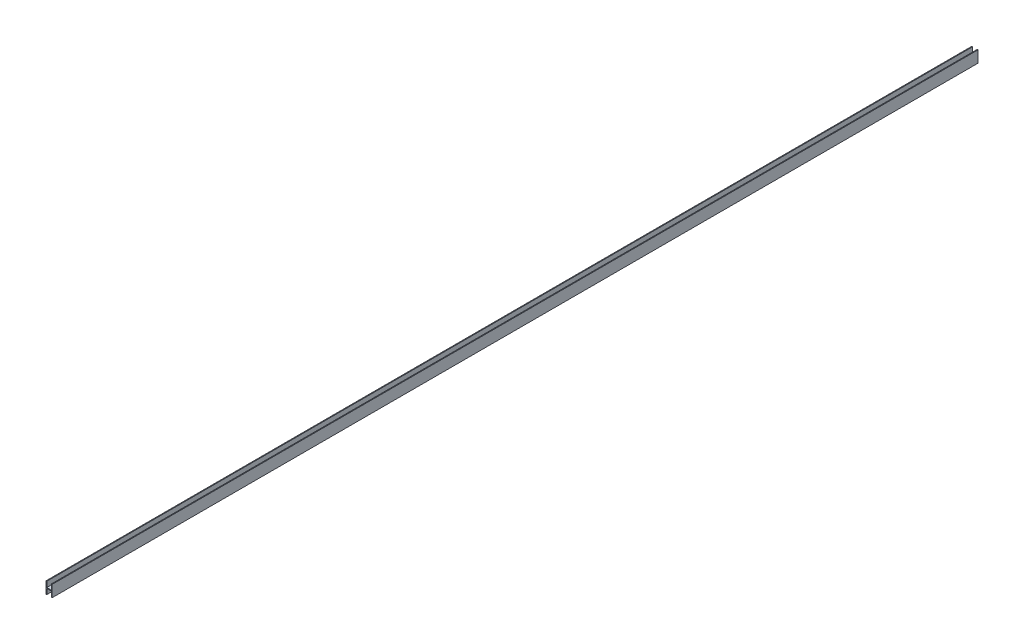
ISO-10303-21;
HEADER;
FILE_DESCRIPTION(('STEP AP214'),'2;1');
FILE_NAME('part.step','',(''),(''),'','','');
FILE_SCHEMA(('AUTOMOTIVE_DESIGN { 1 0 10303 214 1 1 1 1 }'));
ENDSEC;
DATA;
#1=APPLICATION_CONTEXT('core data for automotive mechanical design processes');
#2=APPLICATION_PROTOCOL_DEFINITION('international standard','automotive_design',2000,#1);
#3=PRODUCT_CONTEXT('',#1,'mechanical');
#4=PRODUCT('Part','Part','',(#3));
#5=PRODUCT_RELATED_PRODUCT_CATEGORY('part','',(#4));
#6=PRODUCT_DEFINITION_FORMATION('','',#4);
#7=PRODUCT_DEFINITION_CONTEXT('part definition',#1,'design');
#8=PRODUCT_DEFINITION('design','',#6,#7);
#9=PRODUCT_DEFINITION_SHAPE('','',#8);
#10=(LENGTH_UNIT() NAMED_UNIT(*) SI_UNIT(.MILLI.,.METRE.));
#11=(NAMED_UNIT(*) PLANE_ANGLE_UNIT() SI_UNIT($,.RADIAN.));
#12=(NAMED_UNIT(*) SI_UNIT($,.STERADIAN.) SOLID_ANGLE_UNIT());
#13=UNCERTAINTY_MEASURE_WITH_UNIT(LENGTH_MEASURE(1.E-05),#10,'distance_accuracy_value','');
#14=(GEOMETRIC_REPRESENTATION_CONTEXT(3) GLOBAL_UNCERTAINTY_ASSIGNED_CONTEXT((#13)) GLOBAL_UNIT_ASSIGNED_CONTEXT((#10,
#11,#12)) REPRESENTATION_CONTEXT('',''));
#15=CARTESIAN_POINT('',(0.,0.,0.));
#16=DIRECTION('',(0.,0.,1.));
#17=DIRECTION('',(1.,0.,0.));
#18=AXIS2_PLACEMENT_3D('',#15,#16,#17);
#19=CARTESIAN_POINT('',(-4.,7.5,1200.));
#20=DIRECTION('',(0.,-1.,0.));
#21=DIRECTION('',(0.,0.,-1.));
#22=AXIS2_PLACEMENT_3D('',#19,#20,#21);
#23=PLANE('',#22);
#24=DIRECTION('',(-1.,0.,0.));
#25=VECTOR('',#24,1.);
#26=CARTESIAN_POINT('',(-4.,7.5,1200.));
#27=LINE('',#26,#25);
#28=CARTESIAN_POINT('',(-3.,7.5,1200.));
#29=VERTEX_POINT('',#28);
#30=CARTESIAN_POINT('',(-4.,7.5,1200.));
#31=VERTEX_POINT('',#30);
#32=EDGE_CURVE('E207',#29,#31,#27,.T.);
#33=ORIENTED_EDGE('',*,*,#32,.F.);
#34=DIRECTION('',(0.,0.,-1.));
#35=VECTOR('',#34,1.);
#36=CARTESIAN_POINT('',(-3.,7.5,1200.));
#37=LINE('',#36,#35);
#38=CARTESIAN_POINT('',(-3.,7.5,0.));
#39=VERTEX_POINT('',#38);
#40=EDGE_CURVE('E182',#29,#39,#37,.T.);
#41=ORIENTED_EDGE('',*,*,#40,.T.);
#42=DIRECTION('',(-1.,0.,0.));
#43=VECTOR('',#42,1.);
#44=CARTESIAN_POINT('',(-4.,7.5,0.));
#45=LINE('',#44,#43);
#46=CARTESIAN_POINT('',(-4.,7.5,0.));
#47=VERTEX_POINT('',#46);
#48=EDGE_CURVE('E225',#39,#47,#45,.T.);
#49=ORIENTED_EDGE('',*,*,#48,.T.);
#50=DIRECTION('',(0.,0.,-1.));
#51=VECTOR('',#50,1.);
#52=CARTESIAN_POINT('',(-4.,7.5,1200.));
#53=LINE('',#52,#51);
#54=EDGE_CURVE('E243',#31,#47,#53,.T.);
#55=ORIENTED_EDGE('',*,*,#54,.F.);
#56=EDGE_LOOP('',(#33,#41,#49,#55));
#57=FACE_BOUND('',#56,.T.);
#58=ADVANCED_FACE('F39',(#57),#23,.F.);
#59=CARTESIAN_POINT('',(-4.,-7.5,1200.));
#60=DIRECTION('',(0.,1.,0.));
#61=DIRECTION('',(0.,0.,1.));
#62=AXIS2_PLACEMENT_3D('',#59,#60,#61);
#63=PLANE('',#62);
#64=DIRECTION('',(1.,0.,0.));
#65=VECTOR('',#64,1.);
#66=CARTESIAN_POINT('',(-4.,-7.5,0.));
#67=LINE('',#66,#65);
#68=CARTESIAN_POINT('',(-4.,-7.5,0.));
#69=VERTEX_POINT('',#68);
#70=CARTESIAN_POINT('',(-3.,-7.5,0.));
#71=VERTEX_POINT('',#70);
#72=EDGE_CURVE('E208',#69,#71,#67,.T.);
#73=ORIENTED_EDGE('',*,*,#72,.T.);
#74=DIRECTION('',(0.,0.,1.));
#75=VECTOR('',#74,1.);
#76=CARTESIAN_POINT('',(-3.,-7.5,1200.));
#77=LINE('',#76,#75);
#78=CARTESIAN_POINT('',(-3.,-7.5,1200.));
#79=VERTEX_POINT('',#78);
#80=EDGE_CURVE('E198',#71,#79,#77,.T.);
#81=ORIENTED_EDGE('',*,*,#80,.T.);
#82=DIRECTION('',(1.,0.,0.));
#83=VECTOR('',#82,1.);
#84=CARTESIAN_POINT('',(-4.,-7.5,1200.));
#85=LINE('',#84,#83);
#86=CARTESIAN_POINT('',(-4.,-7.5,1200.));
#87=VERTEX_POINT('',#86);
#88=EDGE_CURVE('E217',#87,#79,#85,.T.);
#89=ORIENTED_EDGE('',*,*,#88,.F.);
#90=DIRECTION('',(0.,0.,-1.));
#91=VECTOR('',#90,1.);
#92=CARTESIAN_POINT('',(-4.,-7.5,1200.));
#93=LINE('',#92,#91);
#94=EDGE_CURVE('E239',#87,#69,#93,.T.);
#95=ORIENTED_EDGE('',*,*,#94,.T.);
#96=EDGE_LOOP('',(#73,#81,#89,#95));
#97=FACE_BOUND('',#96,.T.);
#98=ADVANCED_FACE('F282',(#97),#63,.F.);
#99=CARTESIAN_POINT('',(4.,-7.5,1200.));
#100=DIRECTION('',(-1.,0.,0.));
#101=DIRECTION('',(0.,0.,1.));
#102=AXIS2_PLACEMENT_3D('',#99,#100,#101);
#103=PLANE('',#102);
#104=DIRECTION('',(0.,1.,0.));
#105=VECTOR('',#104,1.);
#106=CARTESIAN_POINT('',(4.,-7.5,0.));
#107=LINE('',#106,#105);
#108=CARTESIAN_POINT('',(4.,-7.5,0.));
#109=VERTEX_POINT('',#108);
#110=CARTESIAN_POINT('',(4.,7.5,0.));
#111=VERTEX_POINT('',#110);
#112=EDGE_CURVE('E202',#109,#111,#107,.T.);
#113=ORIENTED_EDGE('',*,*,#112,.T.);
#114=DIRECTION('',(0.,0.,-1.));
#115=VECTOR('',#114,1.);
#116=CARTESIAN_POINT('',(4.,7.5,1200.));
#117=LINE('',#116,#115);
#118=CARTESIAN_POINT('',(4.,7.5,1200.));
#119=VERTEX_POINT('',#118);
#120=EDGE_CURVE('E247',#119,#111,#117,.T.);
#121=ORIENTED_EDGE('',*,*,#120,.F.);
#122=DIRECTION('',(0.,1.,0.));
#123=VECTOR('',#122,1.);
#124=CARTESIAN_POINT('',(4.,-7.5,1200.));
#125=LINE('',#124,#123);
#126=CARTESIAN_POINT('',(4.,-7.5,1200.));
#127=VERTEX_POINT('',#126);
#128=EDGE_CURVE('E203',#127,#119,#125,.T.);
#129=ORIENTED_EDGE('',*,*,#128,.F.);
#130=DIRECTION('',(0.,0.,-1.));
#131=VECTOR('',#130,1.);
#132=CARTESIAN_POINT('',(4.,-7.5,1200.));
#133=LINE('',#132,#131);
#134=EDGE_CURVE('E221',#127,#109,#133,.T.);
#135=ORIENTED_EDGE('',*,*,#134,.T.);
#136=EDGE_LOOP('',(#113,#121,#129,#135));
#137=FACE_BOUND('',#136,.T.);
#138=ADVANCED_FACE('F41',(#137),#103,.F.);
#139=CARTESIAN_POINT('',(3.,7.5,0.));
#140=VERTEX_POINT('',#139);
#141=EDGE_CURVE('E226',#111,#140,#45,.T.);
#142=ORIENTED_EDGE('',*,*,#141,.T.);
#143=DIRECTION('',(0.,0.,1.));
#144=VECTOR('',#143,1.);
#145=CARTESIAN_POINT('',(3.,7.5,1200.));
#146=LINE('',#145,#144);
#147=CARTESIAN_POINT('',(3.,7.5,1200.));
#148=VERTEX_POINT('',#147);
#149=EDGE_CURVE('E62',#140,#148,#146,.T.);
#150=ORIENTED_EDGE('',*,*,#149,.T.);
#151=EDGE_CURVE('E209',#119,#148,#27,.T.);
#152=ORIENTED_EDGE('',*,*,#151,.F.);
#153=ORIENTED_EDGE('',*,*,#120,.T.);
#154=EDGE_LOOP('',(#142,#150,#152,#153));
#155=FACE_BOUND('',#154,.T.);
#156=ADVANCED_FACE('F263',(#155),#23,.F.);
#157=CARTESIAN_POINT('',(-4.,-7.5,1200.));
#158=DIRECTION('',(1.,0.,0.));
#159=DIRECTION('',(0.,0.,-1.));
#160=AXIS2_PLACEMENT_3D('',#157,#158,#159);
#161=PLANE('',#160);
#162=DIRECTION('',(0.,-1.,0.));
#163=VECTOR('',#162,1.);
#164=CARTESIAN_POINT('',(-4.,-7.5,0.));
#165=LINE('',#164,#163);
#166=EDGE_CURVE('E230',#47,#69,#165,.T.);
#167=ORIENTED_EDGE('',*,*,#166,.T.);
#168=ORIENTED_EDGE('',*,*,#94,.F.);
#169=DIRECTION('',(0.,-1.,0.));
#170=VECTOR('',#169,1.);
#171=CARTESIAN_POINT('',(-4.,-7.5,1200.));
#172=LINE('',#171,#170);
#173=EDGE_CURVE('E213',#31,#87,#172,.T.);
#174=ORIENTED_EDGE('',*,*,#173,.F.);
#175=ORIENTED_EDGE('',*,*,#54,.T.);
#176=EDGE_LOOP('',(#167,#168,#174,#175));
#177=FACE_BOUND('',#176,.T.);
#178=ADVANCED_FACE('F278',(#177),#161,.F.);
#179=CARTESIAN_POINT('',(3.,-7.5,1200.));
#180=VERTEX_POINT('',#179);
#181=EDGE_CURVE('E216',#180,#127,#85,.T.);
#182=ORIENTED_EDGE('',*,*,#181,.F.);
#183=DIRECTION('',(0.,0.,-1.));
#184=VECTOR('',#183,1.);
#185=CARTESIAN_POINT('',(3.,-7.5,1200.));
#186=LINE('',#185,#184);
#187=CARTESIAN_POINT('',(3.,-7.5,0.));
#188=VERTEX_POINT('',#187);
#189=EDGE_CURVE('E191',#180,#188,#186,.T.);
#190=ORIENTED_EDGE('',*,*,#189,.T.);
#191=EDGE_CURVE('E151',#188,#109,#67,.T.);
#192=ORIENTED_EDGE('',*,*,#191,.T.);
#193=ORIENTED_EDGE('',*,*,#134,.F.);
#194=EDGE_LOOP('',(#182,#190,#192,#193));
#195=FACE_BOUND('',#194,.T.);
#196=ADVANCED_FACE('F270',(#195),#63,.F.);
#197=CARTESIAN_POINT('',(0.,0.,1200.));
#198=DIRECTION('',(0.,0.,-1.));
#199=DIRECTION('',(-1.,0.,0.));
#200=AXIS2_PLACEMENT_3D('',#197,#198,#199);
#201=PLANE('',#200);
#202=ORIENTED_EDGE('',*,*,#88,.T.);
#203=DIRECTION('',(0.,1.,0.));
#204=VECTOR('',#203,1.);
#205=CARTESIAN_POINT('',(-3.,0.,1200.));
#206=LINE('',#205,#204);
#207=CARTESIAN_POINT('',(-3.,-0.5,1200.));
#208=VERTEX_POINT('',#207);
#209=EDGE_CURVE('E194',#79,#208,#206,.T.);
#210=ORIENTED_EDGE('',*,*,#209,.T.);
#211=DIRECTION('',(1.,0.,0.));
#212=VECTOR('',#211,1.);
#213=CARTESIAN_POINT('',(0.,-0.5,1200.));
#214=LINE('',#213,#212);
#215=CARTESIAN_POINT('',(3.,-0.5,1200.));
#216=VERTEX_POINT('',#215);
#217=EDGE_CURVE('E186',#208,#216,#214,.T.);
#218=ORIENTED_EDGE('',*,*,#217,.T.);
#219=DIRECTION('',(0.,-1.,0.));
#220=VECTOR('',#219,1.);
#221=CARTESIAN_POINT('',(3.,0.,1200.));
#222=LINE('',#221,#220);
#223=EDGE_CURVE('E135',#216,#180,#222,.T.);
#224=ORIENTED_EDGE('',*,*,#223,.T.);
#225=ORIENTED_EDGE('',*,*,#181,.T.);
#226=ORIENTED_EDGE('',*,*,#128,.T.);
#227=ORIENTED_EDGE('',*,*,#151,.T.);
#228=DIRECTION('',(0.,-1.,0.));
#229=VECTOR('',#228,1.);
#230=CARTESIAN_POINT('',(3.,0.,1200.));
#231=LINE('',#230,#229);
#232=CARTESIAN_POINT('',(3.,0.5,1200.));
#233=VERTEX_POINT('',#232);
#234=EDGE_CURVE('E138',#148,#233,#231,.T.);
#235=ORIENTED_EDGE('',*,*,#234,.T.);
#236=DIRECTION('',(-1.,0.,0.));
#237=VECTOR('',#236,1.);
#238=CARTESIAN_POINT('',(0.,0.5,1200.));
#239=LINE('',#238,#237);
#240=CARTESIAN_POINT('',(-3.,0.5,1200.));
#241=VERTEX_POINT('',#240);
#242=EDGE_CURVE('E174',#233,#241,#239,.T.);
#243=ORIENTED_EDGE('',*,*,#242,.T.);
#244=DIRECTION('',(0.,1.,0.));
#245=VECTOR('',#244,1.);
#246=CARTESIAN_POINT('',(-3.,0.,1200.));
#247=LINE('',#246,#245);
#248=EDGE_CURVE('E178',#241,#29,#247,.T.);
#249=ORIENTED_EDGE('',*,*,#248,.T.);
#250=ORIENTED_EDGE('',*,*,#32,.T.);
#251=ORIENTED_EDGE('',*,*,#173,.T.);
#252=EDGE_LOOP('',(#202,#210,#218,#224,#225,#226,#227,#235,#243,#249,#250,#251));
#253=FACE_BOUND('',#252,.T.);
#254=ADVANCED_FACE('F260',(#253),#201,.F.);
#255=CARTESIAN_POINT('',(0.,0.,0.));
#256=DIRECTION('',(0.,0.,-1.));
#257=DIRECTION('',(-1.,0.,0.));
#258=AXIS2_PLACEMENT_3D('',#255,#256,#257);
#259=PLANE('',#258);
#260=DIRECTION('',(0.,1.,0.));
#261=VECTOR('',#260,1.);
#262=CARTESIAN_POINT('',(-3.,0.,0.));
#263=LINE('',#262,#261);
#264=CARTESIAN_POINT('',(-3.,-0.5,0.));
#265=VERTEX_POINT('',#264);
#266=EDGE_CURVE('E11',#71,#265,#263,.T.);
#267=ORIENTED_EDGE('',*,*,#266,.F.);
#268=ORIENTED_EDGE('',*,*,#72,.F.);
#269=ORIENTED_EDGE('',*,*,#166,.F.);
#270=ORIENTED_EDGE('',*,*,#48,.F.);
#271=DIRECTION('',(0.,1.,0.));
#272=VECTOR('',#271,1.);
#273=CARTESIAN_POINT('',(-3.,0.5,0.));
#274=LINE('',#273,#272);
#275=CARTESIAN_POINT('',(-3.,0.5,0.));
#276=VERTEX_POINT('',#275);
#277=EDGE_CURVE('E157',#276,#39,#274,.T.);
#278=ORIENTED_EDGE('',*,*,#277,.F.);
#279=DIRECTION('',(-1.,0.,0.));
#280=VECTOR('',#279,1.);
#281=CARTESIAN_POINT('',(3.,0.5,0.));
#282=LINE('',#281,#280);
#283=CARTESIAN_POINT('',(3.,0.5,0.));
#284=VERTEX_POINT('',#283);
#285=EDGE_CURVE('E160',#284,#276,#282,.T.);
#286=ORIENTED_EDGE('',*,*,#285,.F.);
#287=DIRECTION('',(0.,-1.,0.));
#288=VECTOR('',#287,1.);
#289=CARTESIAN_POINT('',(3.,0.,0.));
#290=LINE('',#289,#288);
#291=EDGE_CURVE('E48',#140,#284,#290,.T.);
#292=ORIENTED_EDGE('',*,*,#291,.F.);
#293=ORIENTED_EDGE('',*,*,#141,.F.);
#294=ORIENTED_EDGE('',*,*,#112,.F.);
#295=ORIENTED_EDGE('',*,*,#191,.F.);
#296=DIRECTION('',(0.,-1.,0.));
#297=VECTOR('',#296,1.);
#298=CARTESIAN_POINT('',(3.,-14.5,0.));
#299=LINE('',#298,#297);
#300=CARTESIAN_POINT('',(3.,-0.5,0.));
#301=VERTEX_POINT('',#300);
#302=EDGE_CURVE('E132',#301,#188,#299,.T.);
#303=ORIENTED_EDGE('',*,*,#302,.F.);
#304=DIRECTION('',(1.,0.,0.));
#305=VECTOR('',#304,1.);
#306=CARTESIAN_POINT('',(3.,-0.5,0.));
#307=LINE('',#306,#305);
#308=EDGE_CURVE('E141',#265,#301,#307,.T.);
#309=ORIENTED_EDGE('',*,*,#308,.F.);
#310=EDGE_LOOP('',(#267,#268,#269,#270,#278,#286,#292,#293,#294,#295,#303,#309));
#311=FACE_BOUND('',#310,.T.);
#312=ADVANCED_FACE('F149',(#311),#259,.T.);
#313=CARTESIAN_POINT('',(-3.,0.5,2400.));
#314=DIRECTION('',(-1.,0.,0.));
#315=DIRECTION('',(0.,0.,1.));
#316=AXIS2_PLACEMENT_3D('',#313,#314,#315);
#317=PLANE('',#316);
#318=ORIENTED_EDGE('',*,*,#248,.F.);
#319=DIRECTION('',(0.,0.,-1.));
#320=VECTOR('',#319,1.);
#321=CARTESIAN_POINT('',(-3.,0.5,2400.));
#322=LINE('',#321,#320);
#323=EDGE_CURVE('E146',#241,#276,#322,.T.);
#324=ORIENTED_EDGE('',*,*,#323,.T.);
#325=ORIENTED_EDGE('',*,*,#277,.T.);
#326=ORIENTED_EDGE('',*,*,#40,.F.);
#327=EDGE_LOOP('',(#318,#324,#325,#326));
#328=FACE_BOUND('',#327,.T.);
#329=ADVANCED_FACE('F347',(#328),#317,.F.);
#330=CARTESIAN_POINT('',(3.,0.5,2400.));
#331=DIRECTION('',(0.,-1.,0.));
#332=DIRECTION('',(0.,0.,-1.));
#333=AXIS2_PLACEMENT_3D('',#330,#331,#332);
#334=PLANE('',#333);
#335=DIRECTION('',(0.,0.,-1.));
#336=VECTOR('',#335,1.);
#337=CARTESIAN_POINT('',(3.,0.5,2400.));
#338=LINE('',#337,#336);
#339=EDGE_CURVE('E164',#233,#284,#338,.T.);
#340=ORIENTED_EDGE('',*,*,#339,.T.);
#341=ORIENTED_EDGE('',*,*,#285,.T.);
#342=ORIENTED_EDGE('',*,*,#323,.F.);
#343=ORIENTED_EDGE('',*,*,#242,.F.);
#344=EDGE_LOOP('',(#340,#341,#342,#343));
#345=FACE_BOUND('',#344,.T.);
#346=ADVANCED_FACE('F258',(#345),#334,.F.);
#347=CARTESIAN_POINT('',(3.,0.5,2400.));
#348=DIRECTION('',(1.,0.,0.));
#349=DIRECTION('',(0.,0.,-1.));
#350=AXIS2_PLACEMENT_3D('',#347,#348,#349);
#351=PLANE('',#350);
#352=ORIENTED_EDGE('',*,*,#291,.T.);
#353=ORIENTED_EDGE('',*,*,#339,.F.);
#354=ORIENTED_EDGE('',*,*,#234,.F.);
#355=ORIENTED_EDGE('',*,*,#149,.F.);
#356=EDGE_LOOP('',(#352,#353,#354,#355));
#357=FACE_BOUND('',#356,.T.);
#358=ADVANCED_FACE('F253',(#357),#351,.F.);
#359=CARTESIAN_POINT('',(-3.,-14.5,2400.));
#360=DIRECTION('',(-1.,0.,0.));
#361=DIRECTION('',(0.,0.,1.));
#362=AXIS2_PLACEMENT_3D('',#359,#360,#361);
#363=PLANE('',#362);
#364=ORIENTED_EDGE('',*,*,#266,.T.);
#365=DIRECTION('',(0.,0.,-1.));
#366=VECTOR('',#365,1.);
#367=CARTESIAN_POINT('',(-3.,-0.5,2400.));
#368=LINE('',#367,#366);
#369=EDGE_CURVE('E55',#208,#265,#368,.T.);
#370=ORIENTED_EDGE('',*,*,#369,.F.);
#371=ORIENTED_EDGE('',*,*,#209,.F.);
#372=ORIENTED_EDGE('',*,*,#80,.F.);
#373=EDGE_LOOP('',(#364,#370,#371,#372));
#374=FACE_BOUND('',#373,.T.);
#375=ADVANCED_FACE('F287',(#374),#363,.F.);
#376=CARTESIAN_POINT('',(3.,-14.5,2400.));
#377=DIRECTION('',(1.,0.,0.));
#378=DIRECTION('',(0.,0.,-1.));
#379=AXIS2_PLACEMENT_3D('',#376,#377,#378);
#380=PLANE('',#379);
#381=ORIENTED_EDGE('',*,*,#223,.F.);
#382=DIRECTION('',(0.,0.,-1.));
#383=VECTOR('',#382,1.);
#384=CARTESIAN_POINT('',(3.,-0.5,2400.));
#385=LINE('',#384,#383);
#386=EDGE_CURVE('E129',#216,#301,#385,.T.);
#387=ORIENTED_EDGE('',*,*,#386,.T.);
#388=ORIENTED_EDGE('',*,*,#302,.T.);
#389=ORIENTED_EDGE('',*,*,#189,.F.);
#390=EDGE_LOOP('',(#381,#387,#388,#389));
#391=FACE_BOUND('',#390,.T.);
#392=ADVANCED_FACE('F130',(#391),#380,.F.);
#393=CARTESIAN_POINT('',(3.,-0.5,2400.));
#394=DIRECTION('',(0.,1.,0.));
#395=DIRECTION('',(0.,0.,1.));
#396=AXIS2_PLACEMENT_3D('',#393,#394,#395);
#397=PLANE('',#396);
#398=ORIENTED_EDGE('',*,*,#369,.T.);
#399=ORIENTED_EDGE('',*,*,#308,.T.);
#400=ORIENTED_EDGE('',*,*,#386,.F.);
#401=ORIENTED_EDGE('',*,*,#217,.F.);
#402=EDGE_LOOP('',(#398,#399,#400,#401));
#403=FACE_BOUND('',#402,.T.);
#404=ADVANCED_FACE('F142',(#403),#397,.F.);
#405=CLOSED_SHELL('',(#58,#98,#138,#156,#178,#196,#254,#312,#329,#346,#358,#375,#392,#404));
#406=MANIFOLD_SOLID_BREP('B2',#405);
#407=ADVANCED_BREP_SHAPE_REPRESENTATION('',(#18,#406),#14);
#408=SHAPE_DEFINITION_REPRESENTATION(#9,#407);
ENDSEC;
END-ISO-10303-21;
